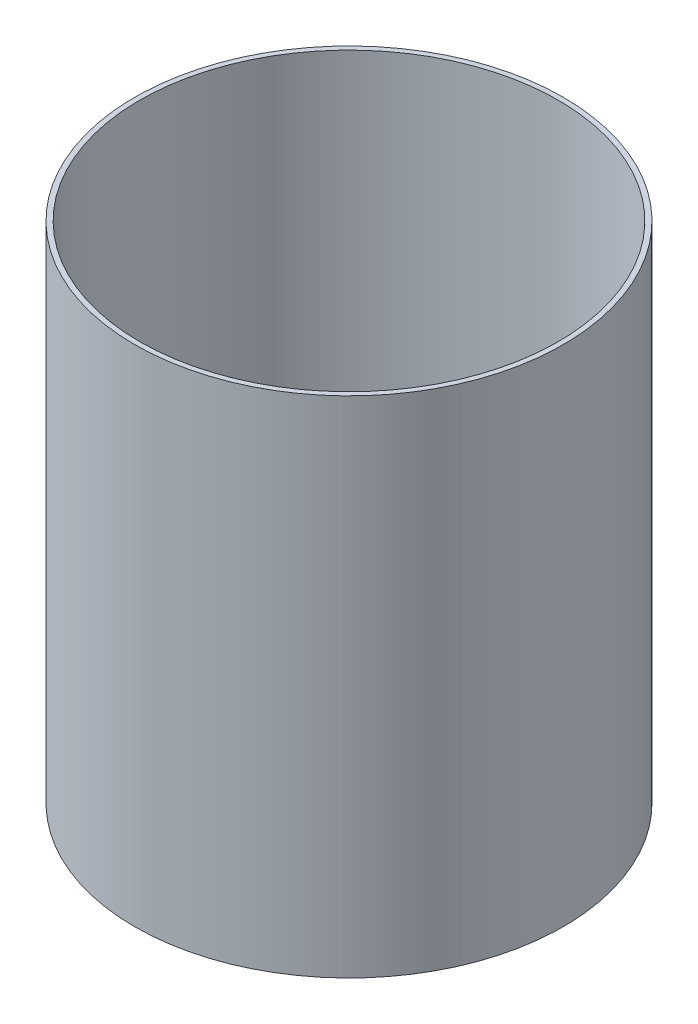
ISO-10303-21;
HEADER;
FILE_DESCRIPTION(('STEP AP214'),'2;1');
FILE_NAME('part.step','',(''),(''),'','','');
FILE_SCHEMA(('AUTOMOTIVE_DESIGN { 1 0 10303 214 1 1 1 1 }'));
ENDSEC;
DATA;
#1=APPLICATION_CONTEXT('core data for automotive mechanical design processes');
#2=APPLICATION_PROTOCOL_DEFINITION('international standard','automotive_design',2000,#1);
#3=PRODUCT_CONTEXT('',#1,'mechanical');
#4=PRODUCT('Part','Part','',(#3));
#5=PRODUCT_RELATED_PRODUCT_CATEGORY('part','',(#4));
#6=PRODUCT_DEFINITION_FORMATION('','',#4);
#7=PRODUCT_DEFINITION_CONTEXT('part definition',#1,'design');
#8=PRODUCT_DEFINITION('design','',#6,#7);
#9=PRODUCT_DEFINITION_SHAPE('','',#8);
#10=(LENGTH_UNIT() NAMED_UNIT(*) SI_UNIT(.MILLI.,.METRE.));
#11=(NAMED_UNIT(*) PLANE_ANGLE_UNIT() SI_UNIT($,.RADIAN.));
#12=(NAMED_UNIT(*) SI_UNIT($,.STERADIAN.) SOLID_ANGLE_UNIT());
#13=UNCERTAINTY_MEASURE_WITH_UNIT(LENGTH_MEASURE(1.E-05),#10,'distance_accuracy_value','');
#14=(GEOMETRIC_REPRESENTATION_CONTEXT(3) GLOBAL_UNCERTAINTY_ASSIGNED_CONTEXT((#13)) GLOBAL_UNIT_ASSIGNED_CONTEXT((#10,
#11,#12)) REPRESENTATION_CONTEXT('',''));
#15=CARTESIAN_POINT('',(0.,0.,0.));
#16=DIRECTION('',(0.,0.,1.));
#17=DIRECTION('',(1.,0.,0.));
#18=AXIS2_PLACEMENT_3D('',#15,#16,#17);
#19=CARTESIAN_POINT('',(0.,50.8,0.));
#20=DIRECTION('',(0.,1.,0.));
#21=DIRECTION('',(0.,0.,1.));
#22=AXIS2_PLACEMENT_3D('',#19,#20,#21);
#23=PLANE('',#22);
#24=CARTESIAN_POINT('',(0.,50.8,0.));
#25=DIRECTION('',(0.,1.,0.));
#26=DIRECTION('',(0.,0.,1.));
#27=AXIS2_PLACEMENT_3D('',#24,#25,#26);
#28=CIRCLE('',#27,21.59);
#29=CARTESIAN_POINT('',(0.,50.8,21.59));
#30=VERTEX_POINT('',#29);
#31=EDGE_CURVE('E10',#30,#30,#28,.T.);
#32=ORIENTED_EDGE('',*,*,#31,.T.);
#33=EDGE_LOOP('',(#32));
#34=FACE_BOUND('',#33,.T.);
#35=CARTESIAN_POINT('',(0.,50.8,0.));
#36=DIRECTION('',(0.,1.,0.));
#37=DIRECTION('',(0.,0.,1.));
#38=AXIS2_PLACEMENT_3D('',#35,#36,#37);
#39=CIRCLE('',#38,21.082);
#40=CARTESIAN_POINT('',(0.,50.8,21.082));
#41=VERTEX_POINT('',#40);
#42=EDGE_CURVE('E42',#41,#41,#39,.T.);
#43=ORIENTED_EDGE('',*,*,#42,.F.);
#44=EDGE_LOOP('',(#43));
#45=FACE_BOUND('',#44,.T.);
#46=ADVANCED_FACE('F31',(#34,#45),#23,.T.);
#47=CARTESIAN_POINT('',(0.,0.,0.));
#48=DIRECTION('',(0.,1.,0.));
#49=DIRECTION('',(0.,0.,1.));
#50=AXIS2_PLACEMENT_3D('',#47,#48,#49);
#51=PLANE('',#50);
#52=CARTESIAN_POINT('',(0.,0.,0.));
#53=DIRECTION('',(0.,1.,0.));
#54=DIRECTION('',(0.,0.,1.));
#55=AXIS2_PLACEMENT_3D('',#52,#53,#54);
#56=CIRCLE('',#55,21.59);
#57=CARTESIAN_POINT('',(0.,0.,21.59));
#58=VERTEX_POINT('',#57);
#59=EDGE_CURVE('E35',#58,#58,#56,.T.);
#60=ORIENTED_EDGE('',*,*,#59,.F.);
#61=EDGE_LOOP('',(#60));
#62=FACE_BOUND('',#61,.T.);
#63=CARTESIAN_POINT('',(0.,0.,0.));
#64=DIRECTION('',(0.,1.,0.));
#65=DIRECTION('',(0.,0.,1.));
#66=AXIS2_PLACEMENT_3D('',#63,#64,#65);
#67=CIRCLE('',#66,21.082);
#68=CARTESIAN_POINT('',(0.,0.,21.082));
#69=VERTEX_POINT('',#68);
#70=EDGE_CURVE('E44',#69,#69,#67,.T.);
#71=ORIENTED_EDGE('',*,*,#70,.T.);
#72=EDGE_LOOP('',(#71));
#73=FACE_BOUND('',#72,.T.);
#74=ADVANCED_FACE('F54',(#62,#73),#51,.F.);
#75=CARTESIAN_POINT('',(0.,50.8,0.));
#76=DIRECTION('',(0.,-1.,0.));
#77=DIRECTION('',(0.,0.,-1.));
#78=AXIS2_PLACEMENT_3D('',#75,#76,#77);
#79=CYLINDRICAL_SURFACE('',#78,21.59);
#80=ORIENTED_EDGE('',*,*,#31,.F.);
#81=EDGE_LOOP('',(#80));
#82=FACE_BOUND('',#81,.T.);
#83=ORIENTED_EDGE('',*,*,#59,.T.);
#84=EDGE_LOOP('',(#83));
#85=FACE_BOUND('',#84,.T.);
#86=ADVANCED_FACE('F33',(#82,#85),#79,.T.);
#87=CARTESIAN_POINT('',(0.,50.8,0.));
#88=DIRECTION('',(0.,-1.,0.));
#89=DIRECTION('',(0.,0.,-1.));
#90=AXIS2_PLACEMENT_3D('',#87,#88,#89);
#91=CYLINDRICAL_SURFACE('',#90,21.082);
#92=ORIENTED_EDGE('',*,*,#42,.T.);
#93=EDGE_LOOP('',(#92));
#94=FACE_BOUND('',#93,.T.);
#95=ORIENTED_EDGE('',*,*,#70,.F.);
#96=EDGE_LOOP('',(#95));
#97=FACE_BOUND('',#96,.T.);
#98=ADVANCED_FACE('F50',(#94,#97),#91,.F.);
#99=CLOSED_SHELL('',(#46,#74,#86,#98));
#100=MANIFOLD_SOLID_BREP('B2',#99);
#101=ADVANCED_BREP_SHAPE_REPRESENTATION('',(#18,#100),#14);
#102=SHAPE_DEFINITION_REPRESENTATION(#9,#101);
ENDSEC;
END-ISO-10303-21;
